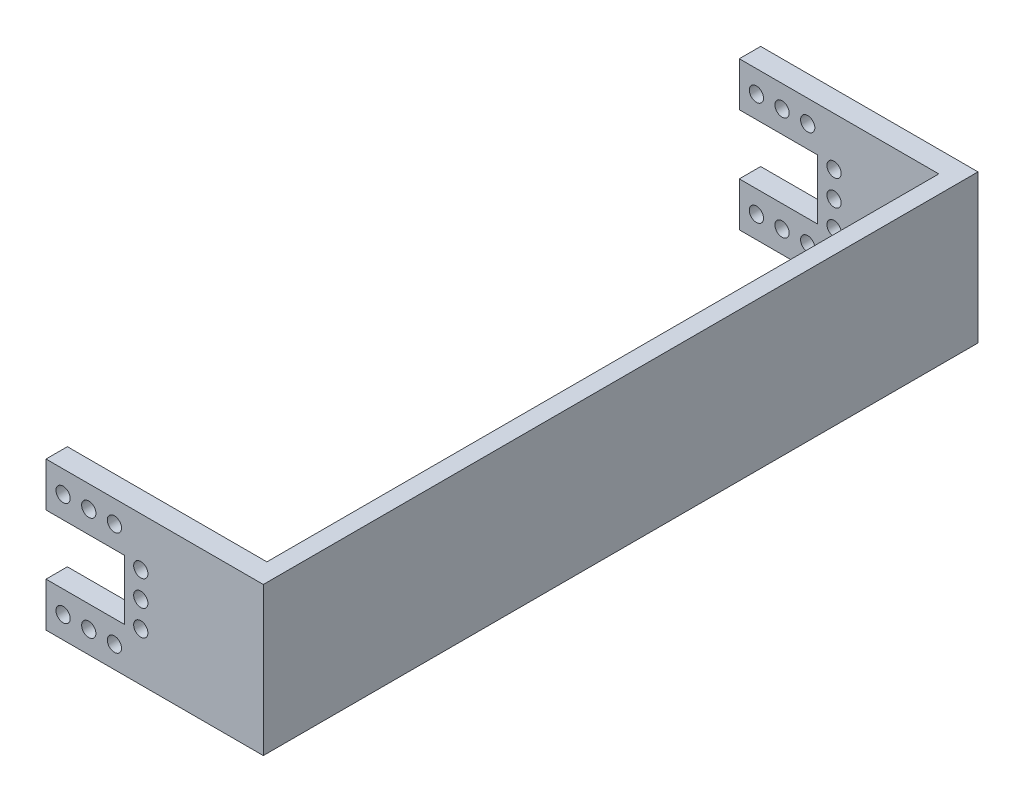
ISO-10303-21;
HEADER;
FILE_DESCRIPTION(('STEP AP214'),'2;1');
FILE_NAME('part.step','',(''),(''),'','','');
FILE_SCHEMA(('AUTOMOTIVE_DESIGN { 1 0 10303 214 1 1 1 1 }'));
ENDSEC;
DATA;
#1=APPLICATION_CONTEXT('core data for automotive mechanical design processes');
#2=APPLICATION_PROTOCOL_DEFINITION('international standard','automotive_design',2000,#1);
#3=PRODUCT_CONTEXT('',#1,'mechanical');
#4=PRODUCT('Part','Part','',(#3));
#5=PRODUCT_RELATED_PRODUCT_CATEGORY('part','',(#4));
#6=PRODUCT_DEFINITION_FORMATION('','',#4);
#7=PRODUCT_DEFINITION_CONTEXT('part definition',#1,'design');
#8=PRODUCT_DEFINITION('design','',#6,#7);
#9=PRODUCT_DEFINITION_SHAPE('','',#8);
#10=(LENGTH_UNIT() NAMED_UNIT(*) SI_UNIT(.MILLI.,.METRE.));
#11=(NAMED_UNIT(*) PLANE_ANGLE_UNIT() SI_UNIT($,.RADIAN.));
#12=(NAMED_UNIT(*) SI_UNIT($,.STERADIAN.) SOLID_ANGLE_UNIT());
#13=UNCERTAINTY_MEASURE_WITH_UNIT(LENGTH_MEASURE(1.E-05),#10,'distance_accuracy_value','');
#14=(GEOMETRIC_REPRESENTATION_CONTEXT(3) GLOBAL_UNCERTAINTY_ASSIGNED_CONTEXT((#13)) GLOBAL_UNIT_ASSIGNED_CONTEXT((#10,
#11,#12)) REPRESENTATION_CONTEXT('',''));
#15=CARTESIAN_POINT('',(0.,0.,0.));
#16=DIRECTION('',(0.,0.,1.));
#17=DIRECTION('',(1.,0.,0.));
#18=AXIS2_PLACEMENT_3D('',#15,#16,#17);
#19=CARTESIAN_POINT('',(32.45,0.,0.));
#20=DIRECTION('',(1.,0.,0.));
#21=DIRECTION('',(0.,0.,-1.));
#22=AXIS2_PLACEMENT_3D('',#19,#20,#21);
#23=PLANE('',#22);
#24=DIRECTION('',(0.,-1.,0.));
#25=VECTOR('',#24,1.);
#26=CARTESIAN_POINT('',(32.45,0.,46.85));
#27=LINE('',#26,#25);
#28=CARTESIAN_POINT('',(32.45,10.3999999999999,46.85));
#29=VERTEX_POINT('',#28);
#30=CARTESIAN_POINT('',(32.45,-10.3999999999999,46.85));
#31=VERTEX_POINT('',#30);
#32=EDGE_CURVE('E348',#29,#31,#27,.T.);
#33=ORIENTED_EDGE('',*,*,#32,.F.);
#34=DIRECTION('',(0.,0.,1.));
#35=VECTOR('',#34,1.);
#36=CARTESIAN_POINT('',(32.45,10.3999999999999,49.85));
#37=LINE('',#36,#35);
#38=CARTESIAN_POINT('',(32.45,10.3999999999999,-47.45));
#39=VERTEX_POINT('',#38);
#40=EDGE_CURVE('E397',#39,#29,#37,.T.);
#41=ORIENTED_EDGE('',*,*,#40,.F.);
#42=DIRECTION('',(0.,-1.,0.));
#43=VECTOR('',#42,1.);
#44=CARTESIAN_POINT('',(32.45,0.,-47.45));
#45=LINE('',#44,#43);
#46=CARTESIAN_POINT('',(32.45,-10.3999999999999,-47.45));
#47=VERTEX_POINT('',#46);
#48=EDGE_CURVE('E176',#39,#47,#45,.T.);
#49=ORIENTED_EDGE('',*,*,#48,.T.);
#50=DIRECTION('',(0.,0.,-1.));
#51=VECTOR('',#50,1.);
#52=CARTESIAN_POINT('',(32.45,-10.3999999999999,49.85));
#53=LINE('',#52,#51);
#54=EDGE_CURVE('E36',#31,#47,#53,.T.);
#55=ORIENTED_EDGE('',*,*,#54,.F.);
#56=EDGE_LOOP('',(#33,#41,#49,#55));
#57=FACE_BOUND('',#56,.T.);
#58=ADVANCED_FACE('F32',(#57),#23,.F.);
#59=CARTESIAN_POINT('',(0.,-10.4000000000002,-50.45));
#60=DIRECTION('',(0.,-1.,0.));
#61=DIRECTION('',(1.,0.,0.));
#62=AXIS2_PLACEMENT_3D('',#59,#60,#61);
#63=PLANE('',#62);
#64=DIRECTION('',(1.,0.,0.));
#65=VECTOR('',#64,1.);
#66=CARTESIAN_POINT('',(0.,-10.4000000000002,-47.45));
#67=LINE('',#66,#65);
#68=CARTESIAN_POINT('',(4.45,-10.4000000000001,-47.45));
#69=VERTEX_POINT('',#68);
#70=EDGE_CURVE('E162',#69,#47,#67,.T.);
#71=ORIENTED_EDGE('',*,*,#70,.F.);
#72=DIRECTION('',(0.,0.,1.));
#73=VECTOR('',#72,1.);
#74=CARTESIAN_POINT('',(4.45,-10.4000000000001,-50.45));
#75=LINE('',#74,#73);
#76=CARTESIAN_POINT('',(4.45,-10.4000000000001,-50.45));
#77=VERTEX_POINT('',#76);
#78=EDGE_CURVE('E11',#77,#69,#75,.T.);
#79=ORIENTED_EDGE('',*,*,#78,.F.);
#80=DIRECTION('',(1.,0.,0.));
#81=VECTOR('',#80,1.);
#82=CARTESIAN_POINT('',(0.,-10.4000000000002,-50.45));
#83=LINE('',#82,#81);
#84=CARTESIAN_POINT('',(34.95,-10.3999999999999,-50.45));
#85=VERTEX_POINT('',#84);
#86=EDGE_CURVE('E194',#77,#85,#83,.T.);
#87=ORIENTED_EDGE('',*,*,#86,.T.);
#88=DIRECTION('',(0.,0.,-1.));
#89=VECTOR('',#88,1.);
#90=CARTESIAN_POINT('',(34.95,-10.3999999999999,49.85));
#91=LINE('',#90,#89);
#92=CARTESIAN_POINT('',(34.95,-10.3999999999999,49.85));
#93=VERTEX_POINT('',#92);
#94=EDGE_CURVE('E396',#93,#85,#91,.T.);
#95=ORIENTED_EDGE('',*,*,#94,.F.);
#96=DIRECTION('',(-1.,0.,0.));
#97=VECTOR('',#96,1.);
#98=CARTESIAN_POINT('',(34.95,-10.3999999999999,49.85));
#99=LINE('',#98,#97);
#100=CARTESIAN_POINT('',(4.45,-10.4000000000001,49.85));
#101=VERTEX_POINT('',#100);
#102=EDGE_CURVE('E184',#93,#101,#99,.T.);
#103=ORIENTED_EDGE('',*,*,#102,.T.);
#104=DIRECTION('',(0.,0.,-1.));
#105=VECTOR('',#104,1.);
#106=CARTESIAN_POINT('',(4.45,-10.4000000000001,49.85));
#107=LINE('',#106,#105);
#108=CARTESIAN_POINT('',(4.45,-10.4000000000001,46.85));
#109=VERTEX_POINT('',#108);
#110=EDGE_CURVE('E390',#101,#109,#107,.T.);
#111=ORIENTED_EDGE('',*,*,#110,.T.);
#112=DIRECTION('',(1.,0.,0.));
#113=VECTOR('',#112,1.);
#114=CARTESIAN_POINT('',(0.,-10.4000000000002,46.85));
#115=LINE('',#114,#113);
#116=EDGE_CURVE('E327',#109,#31,#115,.T.);
#117=ORIENTED_EDGE('',*,*,#116,.T.);
#118=ORIENTED_EDGE('',*,*,#54,.T.);
#119=EDGE_LOOP('',(#71,#79,#87,#95,#103,#111,#117,#118));
#120=FACE_BOUND('',#119,.T.);
#121=ADVANCED_FACE('F34',(#120),#63,.T.);
#122=CARTESIAN_POINT('',(4.45,0.,-50.45));
#123=DIRECTION('',(1.,0.,0.));
#124=DIRECTION('',(0.,0.,-1.));
#125=AXIS2_PLACEMENT_3D('',#122,#123,#124);
#126=PLANE('',#125);
#127=DIRECTION('',(0.,1.,0.));
#128=VECTOR('',#127,1.);
#129=CARTESIAN_POINT('',(4.45,0.,-47.45));
#130=LINE('',#129,#128);
#131=CARTESIAN_POINT('',(4.45,-4.19999999999995,-47.45));
#132=VERTEX_POINT('',#131);
#133=EDGE_CURVE('E159',#69,#132,#130,.T.);
#134=ORIENTED_EDGE('',*,*,#133,.T.);
#135=DIRECTION('',(0.,0.,1.));
#136=VECTOR('',#135,1.);
#137=CARTESIAN_POINT('',(4.45,-4.19999999999995,-50.45));
#138=LINE('',#137,#136);
#139=CARTESIAN_POINT('',(4.45,-4.19999999999995,-50.45));
#140=VERTEX_POINT('',#139);
#141=EDGE_CURVE('E43',#140,#132,#138,.T.);
#142=ORIENTED_EDGE('',*,*,#141,.F.);
#143=DIRECTION('',(0.,1.,0.));
#144=VECTOR('',#143,1.);
#145=CARTESIAN_POINT('',(4.45,0.,-50.45));
#146=LINE('',#145,#144);
#147=EDGE_CURVE('E413',#77,#140,#146,.T.);
#148=ORIENTED_EDGE('',*,*,#147,.F.);
#149=ORIENTED_EDGE('',*,*,#78,.T.);
#150=EDGE_LOOP('',(#134,#142,#148,#149));
#151=FACE_BOUND('',#150,.T.);
#152=ADVANCED_FACE('F262',(#151),#126,.F.);
#153=CARTESIAN_POINT('',(0.,-4.19999999999995,-50.45));
#154=DIRECTION('',(0.,-1.,0.));
#155=DIRECTION('',(0.,0.,-1.));
#156=AXIS2_PLACEMENT_3D('',#153,#154,#155);
#157=PLANE('',#156);
#158=DIRECTION('',(1.,0.,0.));
#159=VECTOR('',#158,1.);
#160=CARTESIAN_POINT('',(0.,-4.19999999999995,-47.45));
#161=LINE('',#160,#159);
#162=CARTESIAN_POINT('',(15.45,-4.19999999999995,-47.45));
#163=VERTEX_POINT('',#162);
#164=EDGE_CURVE('E161',#132,#163,#161,.T.);
#165=ORIENTED_EDGE('',*,*,#164,.T.);
#166=DIRECTION('',(0.,0.,1.));
#167=VECTOR('',#166,1.);
#168=CARTESIAN_POINT('',(15.45,-4.19999999999995,-50.45));
#169=LINE('',#168,#167);
#170=CARTESIAN_POINT('',(15.45,-4.19999999999995,-50.45));
#171=VERTEX_POINT('',#170);
#172=EDGE_CURVE('E109',#171,#163,#169,.T.);
#173=ORIENTED_EDGE('',*,*,#172,.F.);
#174=DIRECTION('',(1.,0.,0.));
#175=VECTOR('',#174,1.);
#176=CARTESIAN_POINT('',(0.,-4.19999999999995,-50.45));
#177=LINE('',#176,#175);
#178=EDGE_CURVE('E120',#140,#171,#177,.T.);
#179=ORIENTED_EDGE('',*,*,#178,.F.);
#180=ORIENTED_EDGE('',*,*,#141,.T.);
#181=EDGE_LOOP('',(#165,#173,#179,#180));
#182=FACE_BOUND('',#181,.T.);
#183=ADVANCED_FACE('F420',(#182),#157,.F.);
#184=CARTESIAN_POINT('',(15.45,0.,-50.45));
#185=DIRECTION('',(-1.,0.,0.));
#186=DIRECTION('',(0.,-1.,0.));
#187=AXIS2_PLACEMENT_3D('',#184,#185,#186);
#188=PLANE('',#187);
#189=DIRECTION('',(0.,-1.,0.));
#190=VECTOR('',#189,1.);
#191=CARTESIAN_POINT('',(15.45,0.,-47.45));
#192=LINE('',#191,#190);
#193=CARTESIAN_POINT('',(15.45,4.19999999999995,-47.45));
#194=VERTEX_POINT('',#193);
#195=EDGE_CURVE('E104',#194,#163,#192,.T.);
#196=ORIENTED_EDGE('',*,*,#195,.F.);
#197=DIRECTION('',(0.,0.,1.));
#198=VECTOR('',#197,1.);
#199=CARTESIAN_POINT('',(15.45,4.19999999999995,-50.45));
#200=LINE('',#199,#198);
#201=CARTESIAN_POINT('',(15.45,4.19999999999995,-50.45));
#202=VERTEX_POINT('',#201);
#203=EDGE_CURVE('E99',#202,#194,#200,.T.);
#204=ORIENTED_EDGE('',*,*,#203,.F.);
#205=DIRECTION('',(0.,-1.,0.));
#206=VECTOR('',#205,1.);
#207=CARTESIAN_POINT('',(15.45,0.,-50.45));
#208=LINE('',#207,#206);
#209=EDGE_CURVE('E102',#202,#171,#208,.T.);
#210=ORIENTED_EDGE('',*,*,#209,.T.);
#211=ORIENTED_EDGE('',*,*,#172,.T.);
#212=EDGE_LOOP('',(#196,#204,#210,#211));
#213=FACE_BOUND('',#212,.T.);
#214=ADVANCED_FACE('F101',(#213),#188,.T.);
#215=CARTESIAN_POINT('',(0.,4.19999999999995,-50.45));
#216=DIRECTION('',(0.,-1.,0.));
#217=DIRECTION('',(1.,0.,0.));
#218=AXIS2_PLACEMENT_3D('',#215,#216,#217);
#219=PLANE('',#218);
#220=DIRECTION('',(1.,0.,0.));
#221=VECTOR('',#220,1.);
#222=CARTESIAN_POINT('',(0.,4.19999999999995,-47.45));
#223=LINE('',#222,#221);
#224=CARTESIAN_POINT('',(4.45,4.19999999999995,-47.45));
#225=VERTEX_POINT('',#224);
#226=EDGE_CURVE('E166',#225,#194,#223,.T.);
#227=ORIENTED_EDGE('',*,*,#226,.F.);
#228=DIRECTION('',(0.,0.,1.));
#229=VECTOR('',#228,1.);
#230=CARTESIAN_POINT('',(4.45,4.19999999999995,-50.45));
#231=LINE('',#230,#229);
#232=CARTESIAN_POINT('',(4.45,4.19999999999995,-50.45));
#233=VERTEX_POINT('',#232);
#234=EDGE_CURVE('E110',#233,#225,#231,.T.);
#235=ORIENTED_EDGE('',*,*,#234,.F.);
#236=DIRECTION('',(1.,0.,0.));
#237=VECTOR('',#236,1.);
#238=CARTESIAN_POINT('',(0.,4.19999999999995,-50.45));
#239=LINE('',#238,#237);
#240=EDGE_CURVE('E118',#233,#202,#239,.T.);
#241=ORIENTED_EDGE('',*,*,#240,.T.);
#242=ORIENTED_EDGE('',*,*,#203,.T.);
#243=EDGE_LOOP('',(#227,#235,#241,#242));
#244=FACE_BOUND('',#243,.T.);
#245=ADVANCED_FACE('F123',(#244),#219,.T.);
#246=CARTESIAN_POINT('',(4.45,0.,-50.45));
#247=DIRECTION('',(-1.,0.,0.));
#248=DIRECTION('',(0.,-1.,0.));
#249=AXIS2_PLACEMENT_3D('',#246,#247,#248);
#250=PLANE('',#249);
#251=DIRECTION('',(0.,-1.,0.));
#252=VECTOR('',#251,1.);
#253=CARTESIAN_POINT('',(4.45,0.,-47.45));
#254=LINE('',#253,#252);
#255=CARTESIAN_POINT('',(4.45,10.4000000000001,-47.45));
#256=VERTEX_POINT('',#255);
#257=EDGE_CURVE('E168',#256,#225,#254,.T.);
#258=ORIENTED_EDGE('',*,*,#257,.F.);
#259=DIRECTION('',(0.,0.,1.));
#260=VECTOR('',#259,1.);
#261=CARTESIAN_POINT('',(4.45,10.4000000000001,-50.45));
#262=LINE('',#261,#260);
#263=CARTESIAN_POINT('',(4.45,10.4000000000001,-50.45));
#264=VERTEX_POINT('',#263);
#265=EDGE_CURVE('E52',#264,#256,#262,.T.);
#266=ORIENTED_EDGE('',*,*,#265,.F.);
#267=DIRECTION('',(0.,-1.,0.));
#268=VECTOR('',#267,1.);
#269=CARTESIAN_POINT('',(4.45,0.,-50.45));
#270=LINE('',#269,#268);
#271=EDGE_CURVE('E124',#264,#233,#270,.T.);
#272=ORIENTED_EDGE('',*,*,#271,.T.);
#273=ORIENTED_EDGE('',*,*,#234,.T.);
#274=EDGE_LOOP('',(#258,#266,#272,#273));
#275=FACE_BOUND('',#274,.T.);
#276=ADVANCED_FACE('F421',(#275),#250,.T.);
#277=CARTESIAN_POINT('',(1.06706648936915E-13,10.4000000000001,-50.45));
#278=DIRECTION('',(0.,-1.,0.));
#279=DIRECTION('',(1.,0.,0.));
#280=AXIS2_PLACEMENT_3D('',#277,#278,#279);
#281=PLANE('',#280);
#282=DIRECTION('',(1.,0.,0.));
#283=VECTOR('',#282,1.);
#284=CARTESIAN_POINT('',(1.06706648936915E-13,10.4000000000001,-47.45));
#285=LINE('',#284,#283);
#286=EDGE_CURVE('E79',#256,#39,#285,.T.);
#287=ORIENTED_EDGE('',*,*,#286,.T.);
#288=ORIENTED_EDGE('',*,*,#40,.T.);
#289=DIRECTION('',(1.,0.,0.));
#290=VECTOR('',#289,1.);
#291=CARTESIAN_POINT('',(1.06706648936915E-13,10.4000000000001,46.85));
#292=LINE('',#291,#290);
#293=CARTESIAN_POINT('',(4.45,10.4000000000001,46.85));
#294=VERTEX_POINT('',#293);
#295=EDGE_CURVE('E345',#294,#29,#292,.T.);
#296=ORIENTED_EDGE('',*,*,#295,.F.);
#297=DIRECTION('',(0.,0.,-1.));
#298=VECTOR('',#297,1.);
#299=CARTESIAN_POINT('',(4.45,10.4000000000001,49.85));
#300=LINE('',#299,#298);
#301=CARTESIAN_POINT('',(4.45,10.4000000000001,49.85));
#302=VERTEX_POINT('',#301);
#303=EDGE_CURVE('E319',#302,#294,#300,.T.);
#304=ORIENTED_EDGE('',*,*,#303,.F.);
#305=DIRECTION('',(-1.,0.,0.));
#306=VECTOR('',#305,1.);
#307=CARTESIAN_POINT('',(34.95,10.3999999999999,49.85));
#308=LINE('',#307,#306);
#309=CARTESIAN_POINT('',(34.95,10.3999999999999,49.85));
#310=VERTEX_POINT('',#309);
#311=EDGE_CURVE('E281',#310,#302,#308,.T.);
#312=ORIENTED_EDGE('',*,*,#311,.F.);
#313=DIRECTION('',(0.,0.,1.));
#314=VECTOR('',#313,1.);
#315=CARTESIAN_POINT('',(34.95,10.3999999999999,49.85));
#316=LINE('',#315,#314);
#317=CARTESIAN_POINT('',(34.95,10.3999999999999,-50.45));
#318=VERTEX_POINT('',#317);
#319=EDGE_CURVE('E403',#318,#310,#316,.T.);
#320=ORIENTED_EDGE('',*,*,#319,.F.);
#321=DIRECTION('',(1.,0.,0.));
#322=VECTOR('',#321,1.);
#323=CARTESIAN_POINT('',(1.06706648936915E-13,10.4000000000001,-50.45));
#324=LINE('',#323,#322);
#325=EDGE_CURVE('E126',#264,#318,#324,.T.);
#326=ORIENTED_EDGE('',*,*,#325,.F.);
#327=ORIENTED_EDGE('',*,*,#265,.T.);
#328=EDGE_LOOP('',(#287,#288,#296,#304,#312,#320,#326,#327));
#329=FACE_BOUND('',#328,.T.);
#330=ADVANCED_FACE('F428',(#329),#281,.F.);
#331=CARTESIAN_POINT('',(17.75,-3.60000000000005,-50.45));
#332=DIRECTION('',(0.,0.,1.));
#333=DIRECTION('',(1.,0.,0.));
#334=AXIS2_PLACEMENT_3D('',#331,#332,#333);
#335=CYLINDRICAL_SURFACE('',#334,1.);
#336=CARTESIAN_POINT('',(17.75,-3.60000000000005,-50.45));
#337=DIRECTION('',(0.,0.,-1.));
#338=DIRECTION('',(-1.,0.,0.));
#339=AXIS2_PLACEMENT_3D('',#336,#337,#338);
#340=CIRCLE('',#339,1.);
#341=CARTESIAN_POINT('',(16.75,-3.60000000000005,-50.45));
#342=VERTEX_POINT('',#341);
#343=EDGE_CURVE('E153',#342,#342,#340,.F.);
#344=ORIENTED_EDGE('',*,*,#343,.F.);
#345=EDGE_LOOP('',(#344));
#346=FACE_BOUND('',#345,.T.);
#347=CARTESIAN_POINT('',(17.75,-3.60000000000005,-47.45));
#348=DIRECTION('',(0.,0.,-1.));
#349=DIRECTION('',(-1.,0.,0.));
#350=AXIS2_PLACEMENT_3D('',#347,#348,#349);
#351=CIRCLE('',#350,1.);
#352=CARTESIAN_POINT('',(16.75,-3.60000000000005,-47.45));
#353=VERTEX_POINT('',#352);
#354=EDGE_CURVE('E195',#353,#353,#351,.F.);
#355=ORIENTED_EDGE('',*,*,#354,.T.);
#356=EDGE_LOOP('',(#355));
#357=FACE_BOUND('',#356,.T.);
#358=ADVANCED_FACE('F678',(#346,#357),#335,.F.);
#359=CARTESIAN_POINT('',(10.4499999999999,-7.29999999999995,-50.45));
#360=DIRECTION('',(0.,0.,1.));
#361=DIRECTION('',(1.,0.,0.));
#362=AXIS2_PLACEMENT_3D('',#359,#360,#361);
#363=CYLINDRICAL_SURFACE('',#362,1.);
#364=CARTESIAN_POINT('',(10.4499999999999,-7.29999999999995,-50.45));
#365=DIRECTION('',(0.,0.,-1.));
#366=DIRECTION('',(-1.,0.,0.));
#367=AXIS2_PLACEMENT_3D('',#364,#365,#366);
#368=CIRCLE('',#367,1.);
#369=CARTESIAN_POINT('',(9.44999999999987,-7.29999999999995,-50.45));
#370=VERTEX_POINT('',#369);
#371=EDGE_CURVE('E150',#370,#370,#368,.F.);
#372=ORIENTED_EDGE('',*,*,#371,.F.);
#373=EDGE_LOOP('',(#372));
#374=FACE_BOUND('',#373,.T.);
#375=CARTESIAN_POINT('',(10.4499999999999,-7.29999999999995,-47.45));
#376=DIRECTION('',(0.,0.,-1.));
#377=DIRECTION('',(-1.,0.,0.));
#378=AXIS2_PLACEMENT_3D('',#375,#376,#377);
#379=CIRCLE('',#378,1.);
#380=CARTESIAN_POINT('',(9.44999999999987,-7.29999999999995,-47.45));
#381=VERTEX_POINT('',#380);
#382=EDGE_CURVE('E198',#381,#381,#379,.F.);
#383=ORIENTED_EDGE('',*,*,#382,.T.);
#384=EDGE_LOOP('',(#383));
#385=FACE_BOUND('',#384,.T.);
#386=ADVANCED_FACE('F839',(#374,#385),#363,.F.);
#387=CARTESIAN_POINT('',(6.84999999999987,-7.29999999999991,-50.45));
#388=DIRECTION('',(0.,0.,1.));
#389=DIRECTION('',(1.,0.,0.));
#390=AXIS2_PLACEMENT_3D('',#387,#388,#389);
#391=CYLINDRICAL_SURFACE('',#390,0.999999999999999);
#392=CARTESIAN_POINT('',(6.84999999999987,-7.29999999999991,-50.45));
#393=DIRECTION('',(0.,0.,-1.));
#394=DIRECTION('',(-1.,0.,0.));
#395=AXIS2_PLACEMENT_3D('',#392,#393,#394);
#396=CIRCLE('',#395,0.999999999999999);
#397=CARTESIAN_POINT('',(5.84999999999987,-7.29999999999991,-50.45));
#398=VERTEX_POINT('',#397);
#399=EDGE_CURVE('E147',#398,#398,#396,.F.);
#400=ORIENTED_EDGE('',*,*,#399,.F.);
#401=EDGE_LOOP('',(#400));
#402=FACE_BOUND('',#401,.T.);
#403=CARTESIAN_POINT('',(6.84999999999987,-7.29999999999991,-47.45));
#404=DIRECTION('',(0.,0.,-1.));
#405=DIRECTION('',(-1.,0.,0.));
#406=AXIS2_PLACEMENT_3D('',#403,#404,#405);
#407=CIRCLE('',#406,0.999999999999999);
#408=CARTESIAN_POINT('',(5.84999999999987,-7.29999999999991,-47.45));
#409=VERTEX_POINT('',#408);
#410=EDGE_CURVE('E201',#409,#409,#407,.F.);
#411=ORIENTED_EDGE('',*,*,#410,.T.);
#412=EDGE_LOOP('',(#411));
#413=FACE_BOUND('',#412,.T.);
#414=ADVANCED_FACE('F830',(#402,#413),#391,.F.);
#415=CARTESIAN_POINT('',(14.0500000000002,7.29999999999999,-50.45));
#416=DIRECTION('',(0.,0.,1.));
#417=DIRECTION('',(1.,0.,0.));
#418=AXIS2_PLACEMENT_3D('',#415,#416,#417);
#419=CYLINDRICAL_SURFACE('',#418,1.);
#420=CARTESIAN_POINT('',(14.0500000000002,7.29999999999999,-50.45));
#421=DIRECTION('',(0.,0.,-1.));
#422=DIRECTION('',(-1.,0.,0.));
#423=AXIS2_PLACEMENT_3D('',#420,#421,#422);
#424=CIRCLE('',#423,1.);
#425=CARTESIAN_POINT('',(13.0500000000002,7.29999999999999,-50.45));
#426=VERTEX_POINT('',#425);
#427=EDGE_CURVE('E144',#426,#426,#424,.F.);
#428=ORIENTED_EDGE('',*,*,#427,.F.);
#429=EDGE_LOOP('',(#428));
#430=FACE_BOUND('',#429,.T.);
#431=CARTESIAN_POINT('',(14.0500000000002,7.29999999999999,-47.45));
#432=DIRECTION('',(0.,0.,-1.));
#433=DIRECTION('',(-1.,0.,0.));
#434=AXIS2_PLACEMENT_3D('',#431,#432,#433);
#435=CIRCLE('',#434,1.);
#436=CARTESIAN_POINT('',(13.0500000000002,7.29999999999999,-47.45));
#437=VERTEX_POINT('',#436);
#438=EDGE_CURVE('E204',#437,#437,#435,.F.);
#439=ORIENTED_EDGE('',*,*,#438,.T.);
#440=EDGE_LOOP('',(#439));
#441=FACE_BOUND('',#440,.T.);
#442=ADVANCED_FACE('F821',(#430,#441),#419,.F.);
#443=CARTESIAN_POINT('',(10.4500000000002,7.30000000000005,-50.45));
#444=DIRECTION('',(0.,0.,1.));
#445=DIRECTION('',(1.,0.,0.));
#446=AXIS2_PLACEMENT_3D('',#443,#444,#445);
#447=CYLINDRICAL_SURFACE('',#446,1.);
#448=CARTESIAN_POINT('',(10.4500000000002,7.30000000000005,-50.45));
#449=DIRECTION('',(0.,0.,-1.));
#450=DIRECTION('',(-1.,0.,0.));
#451=AXIS2_PLACEMENT_3D('',#448,#449,#450);
#452=CIRCLE('',#451,1.);
#453=CARTESIAN_POINT('',(9.45000000000018,7.30000000000005,-50.45));
#454=VERTEX_POINT('',#453);
#455=EDGE_CURVE('E141',#454,#454,#452,.F.);
#456=ORIENTED_EDGE('',*,*,#455,.F.);
#457=EDGE_LOOP('',(#456));
#458=FACE_BOUND('',#457,.T.);
#459=CARTESIAN_POINT('',(10.4500000000002,7.30000000000005,-47.45));
#460=DIRECTION('',(0.,0.,-1.));
#461=DIRECTION('',(-1.,0.,0.));
#462=AXIS2_PLACEMENT_3D('',#459,#460,#461);
#463=CIRCLE('',#462,1.);
#464=CARTESIAN_POINT('',(9.45000000000018,7.30000000000005,-47.45));
#465=VERTEX_POINT('',#464);
#466=EDGE_CURVE('E207',#465,#465,#463,.F.);
#467=ORIENTED_EDGE('',*,*,#466,.T.);
#468=EDGE_LOOP('',(#467));
#469=FACE_BOUND('',#468,.T.);
#470=ADVANCED_FACE('F812',(#458,#469),#447,.F.);
#471=CARTESIAN_POINT('',(17.75,3.59999999999995,-50.45));
#472=DIRECTION('',(0.,0.,1.));
#473=DIRECTION('',(1.,0.,0.));
#474=AXIS2_PLACEMENT_3D('',#471,#472,#473);
#475=CYLINDRICAL_SURFACE('',#474,0.999999999999998);
#476=CARTESIAN_POINT('',(17.75,3.59999999999995,-50.45));
#477=DIRECTION('',(0.,0.,-1.));
#478=DIRECTION('',(-1.,0.,0.));
#479=AXIS2_PLACEMENT_3D('',#476,#477,#478);
#480=CIRCLE('',#479,0.999999999999998);
#481=CARTESIAN_POINT('',(16.75,3.59999999999995,-50.45));
#482=VERTEX_POINT('',#481);
#483=EDGE_CURVE('E138',#482,#482,#480,.F.);
#484=ORIENTED_EDGE('',*,*,#483,.F.);
#485=EDGE_LOOP('',(#484));
#486=FACE_BOUND('',#485,.T.);
#487=CARTESIAN_POINT('',(17.75,3.59999999999995,-47.45));
#488=DIRECTION('',(0.,0.,-1.));
#489=DIRECTION('',(-1.,0.,0.));
#490=AXIS2_PLACEMENT_3D('',#487,#488,#489);
#491=CIRCLE('',#490,0.999999999999998);
#492=CARTESIAN_POINT('',(16.75,3.59999999999995,-47.45));
#493=VERTEX_POINT('',#492);
#494=EDGE_CURVE('E210',#493,#493,#491,.F.);
#495=ORIENTED_EDGE('',*,*,#494,.T.);
#496=EDGE_LOOP('',(#495));
#497=FACE_BOUND('',#496,.T.);
#498=ADVANCED_FACE('F803',(#486,#497),#475,.F.);
#499=CARTESIAN_POINT('',(6.85000000000018,7.30000000000009,-50.45));
#500=DIRECTION('',(0.,0.,1.));
#501=DIRECTION('',(1.,0.,0.));
#502=AXIS2_PLACEMENT_3D('',#499,#500,#501);
#503=CYLINDRICAL_SURFACE('',#502,0.999999999999998);
#504=CARTESIAN_POINT('',(6.85000000000018,7.30000000000009,-50.45));
#505=DIRECTION('',(0.,0.,-1.));
#506=DIRECTION('',(-1.,0.,0.));
#507=AXIS2_PLACEMENT_3D('',#504,#505,#506);
#508=CIRCLE('',#507,0.999999999999998);
#509=CARTESIAN_POINT('',(5.85000000000018,7.30000000000009,-50.45));
#510=VERTEX_POINT('',#509);
#511=EDGE_CURVE('E135',#510,#510,#508,.F.);
#512=ORIENTED_EDGE('',*,*,#511,.F.);
#513=EDGE_LOOP('',(#512));
#514=FACE_BOUND('',#513,.T.);
#515=CARTESIAN_POINT('',(6.85000000000018,7.30000000000009,-47.45));
#516=DIRECTION('',(0.,0.,-1.));
#517=DIRECTION('',(-1.,0.,0.));
#518=AXIS2_PLACEMENT_3D('',#515,#516,#517);
#519=CIRCLE('',#518,0.999999999999998);
#520=CARTESIAN_POINT('',(5.85000000000018,7.30000000000009,-47.45));
#521=VERTEX_POINT('',#520);
#522=EDGE_CURVE('E212',#521,#521,#519,.F.);
#523=ORIENTED_EDGE('',*,*,#522,.T.);
#524=EDGE_LOOP('',(#523));
#525=FACE_BOUND('',#524,.T.);
#526=ADVANCED_FACE('F251',(#514,#525),#503,.F.);
#527=CARTESIAN_POINT('',(17.75,0.,-50.45));
#528=DIRECTION('',(0.,0.,1.));
#529=DIRECTION('',(1.,0.,0.));
#530=AXIS2_PLACEMENT_3D('',#527,#528,#529);
#531=CYLINDRICAL_SURFACE('',#530,1.);
#532=CARTESIAN_POINT('',(17.75,0.,-50.45));
#533=DIRECTION('',(0.,0.,-1.));
#534=DIRECTION('',(-1.,0.,0.));
#535=AXIS2_PLACEMENT_3D('',#532,#533,#534);
#536=CIRCLE('',#535,1.);
#537=CARTESIAN_POINT('',(16.75,0.,-50.45));
#538=VERTEX_POINT('',#537);
#539=EDGE_CURVE('E132',#538,#538,#536,.F.);
#540=ORIENTED_EDGE('',*,*,#539,.F.);
#541=EDGE_LOOP('',(#540));
#542=FACE_BOUND('',#541,.T.);
#543=CARTESIAN_POINT('',(17.75,0.,-47.45));
#544=DIRECTION('',(0.,0.,-1.));
#545=DIRECTION('',(-1.,0.,0.));
#546=AXIS2_PLACEMENT_3D('',#543,#544,#545);
#547=CIRCLE('',#546,1.);
#548=CARTESIAN_POINT('',(16.75,0.,-47.45));
#549=VERTEX_POINT('',#548);
#550=EDGE_CURVE('E173',#549,#549,#547,.F.);
#551=ORIENTED_EDGE('',*,*,#550,.T.);
#552=EDGE_LOOP('',(#551));
#553=FACE_BOUND('',#552,.T.);
#554=ADVANCED_FACE('F219',(#542,#553),#531,.F.);
#555=CARTESIAN_POINT('',(14.0499999999999,-7.29999999999996,-50.45));
#556=DIRECTION('',(0.,0.,1.));
#557=DIRECTION('',(1.,0.,0.));
#558=AXIS2_PLACEMENT_3D('',#555,#556,#557);
#559=CYLINDRICAL_SURFACE('',#558,0.999999999999999);
#560=CARTESIAN_POINT('',(14.0499999999999,-7.29999999999996,-50.45));
#561=DIRECTION('',(0.,0.,-1.));
#562=DIRECTION('',(-1.,0.,0.));
#563=AXIS2_PLACEMENT_3D('',#560,#561,#562);
#564=CIRCLE('',#563,0.999999999999999);
#565=CARTESIAN_POINT('',(13.0499999999999,-7.29999999999996,-50.45));
#566=VERTEX_POINT('',#565);
#567=EDGE_CURVE('E156',#566,#566,#564,.F.);
#568=ORIENTED_EDGE('',*,*,#567,.F.);
#569=EDGE_LOOP('',(#568));
#570=FACE_BOUND('',#569,.T.);
#571=CARTESIAN_POINT('',(14.0499999999999,-7.29999999999996,-47.45));
#572=DIRECTION('',(0.,0.,-1.));
#573=DIRECTION('',(-1.,0.,0.));
#574=AXIS2_PLACEMENT_3D('',#571,#572,#573);
#575=CIRCLE('',#574,0.999999999999999);
#576=CARTESIAN_POINT('',(13.0499999999999,-7.29999999999996,-47.45));
#577=VERTEX_POINT('',#576);
#578=EDGE_CURVE('E191',#577,#577,#575,.F.);
#579=ORIENTED_EDGE('',*,*,#578,.T.);
#580=EDGE_LOOP('',(#579));
#581=FACE_BOUND('',#580,.T.);
#582=ADVANCED_FACE('F242',(#570,#581),#559,.F.);
#583=CARTESIAN_POINT('',(0.,0.,-50.45));
#584=DIRECTION('',(0.,0.,-1.));
#585=DIRECTION('',(-1.,0.,0.));
#586=AXIS2_PLACEMENT_3D('',#583,#584,#585);
#587=PLANE('',#586);
#588=ORIENTED_EDGE('',*,*,#86,.F.);
#589=ORIENTED_EDGE('',*,*,#147,.T.);
#590=ORIENTED_EDGE('',*,*,#178,.T.);
#591=ORIENTED_EDGE('',*,*,#209,.F.);
#592=ORIENTED_EDGE('',*,*,#240,.F.);
#593=ORIENTED_EDGE('',*,*,#271,.F.);
#594=ORIENTED_EDGE('',*,*,#325,.T.);
#595=DIRECTION('',(0.,1.,0.));
#596=VECTOR('',#595,1.);
#597=CARTESIAN_POINT('',(34.95,10.3999999999999,-50.45));
#598=LINE('',#597,#596);
#599=EDGE_CURVE('E400',#85,#318,#598,.T.);
#600=ORIENTED_EDGE('',*,*,#599,.F.);
#601=EDGE_LOOP('',(#588,#589,#590,#591,#592,#593,#594,#600));
#602=FACE_BOUND('',#601,.T.);
#603=ORIENTED_EDGE('',*,*,#539,.T.);
#604=EDGE_LOOP('',(#603));
#605=FACE_BOUND('',#604,.T.);
#606=ORIENTED_EDGE('',*,*,#511,.T.);
#607=EDGE_LOOP('',(#606));
#608=FACE_BOUND('',#607,.T.);
#609=ORIENTED_EDGE('',*,*,#483,.T.);
#610=EDGE_LOOP('',(#609));
#611=FACE_BOUND('',#610,.T.);
#612=ORIENTED_EDGE('',*,*,#455,.T.);
#613=EDGE_LOOP('',(#612));
#614=FACE_BOUND('',#613,.T.);
#615=ORIENTED_EDGE('',*,*,#427,.T.);
#616=EDGE_LOOP('',(#615));
#617=FACE_BOUND('',#616,.T.);
#618=ORIENTED_EDGE('',*,*,#399,.T.);
#619=EDGE_LOOP('',(#618));
#620=FACE_BOUND('',#619,.T.);
#621=ORIENTED_EDGE('',*,*,#371,.T.);
#622=EDGE_LOOP('',(#621));
#623=FACE_BOUND('',#622,.T.);
#624=ORIENTED_EDGE('',*,*,#343,.T.);
#625=EDGE_LOOP('',(#624));
#626=FACE_BOUND('',#625,.T.);
#627=ORIENTED_EDGE('',*,*,#567,.T.);
#628=EDGE_LOOP('',(#627));
#629=FACE_BOUND('',#628,.T.);
#630=ADVANCED_FACE('F115',(#602,#605,#608,#611,#614,#617,#620,#623,#626,#629),#587,.T.);
#631=CARTESIAN_POINT('',(0.,0.,-47.45));
#632=DIRECTION('',(0.,0.,-1.));
#633=DIRECTION('',(-1.,0.,0.));
#634=AXIS2_PLACEMENT_3D('',#631,#632,#633);
#635=PLANE('',#634);
#636=ORIENTED_EDGE('',*,*,#70,.T.);
#637=ORIENTED_EDGE('',*,*,#48,.F.);
#638=ORIENTED_EDGE('',*,*,#286,.F.);
#639=ORIENTED_EDGE('',*,*,#257,.T.);
#640=ORIENTED_EDGE('',*,*,#226,.T.);
#641=ORIENTED_EDGE('',*,*,#195,.T.);
#642=ORIENTED_EDGE('',*,*,#164,.F.);
#643=ORIENTED_EDGE('',*,*,#133,.F.);
#644=EDGE_LOOP('',(#636,#637,#638,#639,#640,#641,#642,#643));
#645=FACE_BOUND('',#644,.T.);
#646=ORIENTED_EDGE('',*,*,#550,.F.);
#647=EDGE_LOOP('',(#646));
#648=FACE_BOUND('',#647,.T.);
#649=ORIENTED_EDGE('',*,*,#522,.F.);
#650=EDGE_LOOP('',(#649));
#651=FACE_BOUND('',#650,.T.);
#652=ORIENTED_EDGE('',*,*,#494,.F.);
#653=EDGE_LOOP('',(#652));
#654=FACE_BOUND('',#653,.T.);
#655=ORIENTED_EDGE('',*,*,#466,.F.);
#656=EDGE_LOOP('',(#655));
#657=FACE_BOUND('',#656,.T.);
#658=ORIENTED_EDGE('',*,*,#438,.F.);
#659=EDGE_LOOP('',(#658));
#660=FACE_BOUND('',#659,.T.);
#661=ORIENTED_EDGE('',*,*,#410,.F.);
#662=EDGE_LOOP('',(#661));
#663=FACE_BOUND('',#662,.T.);
#664=ORIENTED_EDGE('',*,*,#382,.F.);
#665=EDGE_LOOP('',(#664));
#666=FACE_BOUND('',#665,.T.);
#667=ORIENTED_EDGE('',*,*,#354,.F.);
#668=EDGE_LOOP('',(#667));
#669=FACE_BOUND('',#668,.T.);
#670=ORIENTED_EDGE('',*,*,#578,.F.);
#671=EDGE_LOOP('',(#670));
#672=FACE_BOUND('',#671,.T.);
#673=ADVANCED_FACE('F221',(#645,#648,#651,#654,#657,#660,#663,#666,#669,#672),#635,.F.);
#674=CARTESIAN_POINT('',(34.95,10.3999999999999,49.85));
#675=DIRECTION('',(0.,0.,-1.));
#676=DIRECTION('',(-1.,0.,0.));
#677=AXIS2_PLACEMENT_3D('',#674,#675,#676);
#678=PLANE('',#677);
#679=ORIENTED_EDGE('',*,*,#311,.T.);
#680=DIRECTION('',(0.,-1.,0.));
#681=VECTOR('',#680,1.);
#682=CARTESIAN_POINT('',(4.45,0.,49.85));
#683=LINE('',#682,#681);
#684=CARTESIAN_POINT('',(4.45,4.19999999999995,49.85));
#685=VERTEX_POINT('',#684);
#686=EDGE_CURVE('E488',#302,#685,#683,.T.);
#687=ORIENTED_EDGE('',*,*,#686,.T.);
#688=DIRECTION('',(1.,0.,0.));
#689=VECTOR('',#688,1.);
#690=CARTESIAN_POINT('',(0.,4.19999999999995,49.85));
#691=LINE('',#690,#689);
#692=CARTESIAN_POINT('',(15.45,4.19999999999995,49.85));
#693=VERTEX_POINT('',#692);
#694=EDGE_CURVE('E499',#685,#693,#691,.T.);
#695=ORIENTED_EDGE('',*,*,#694,.T.);
#696=DIRECTION('',(0.,-1.,0.));
#697=VECTOR('',#696,1.);
#698=CARTESIAN_POINT('',(15.45,0.,49.85));
#699=LINE('',#698,#697);
#700=CARTESIAN_POINT('',(15.45,-4.19999999999995,49.85));
#701=VERTEX_POINT('',#700);
#702=EDGE_CURVE('E498',#693,#701,#699,.T.);
#703=ORIENTED_EDGE('',*,*,#702,.T.);
#704=DIRECTION('',(1.,0.,0.));
#705=VECTOR('',#704,1.);
#706=CARTESIAN_POINT('',(0.,-4.19999999999995,49.85));
#707=LINE('',#706,#705);
#708=CARTESIAN_POINT('',(4.45,-4.19999999999995,49.85));
#709=VERTEX_POINT('',#708);
#710=EDGE_CURVE('E473',#709,#701,#707,.T.);
#711=ORIENTED_EDGE('',*,*,#710,.F.);
#712=DIRECTION('',(0.,1.,0.));
#713=VECTOR('',#712,1.);
#714=CARTESIAN_POINT('',(4.45,0.,49.85));
#715=LINE('',#714,#713);
#716=EDGE_CURVE('E377',#101,#709,#715,.T.);
#717=ORIENTED_EDGE('',*,*,#716,.F.);
#718=ORIENTED_EDGE('',*,*,#102,.F.);
#719=DIRECTION('',(0.,-1.,0.));
#720=VECTOR('',#719,1.);
#721=CARTESIAN_POINT('',(34.95,10.3999999999999,49.85));
#722=LINE('',#721,#720);
#723=EDGE_CURVE('E393',#310,#93,#722,.T.);
#724=ORIENTED_EDGE('',*,*,#723,.F.);
#725=EDGE_LOOP('',(#679,#687,#695,#703,#711,#717,#718,#724));
#726=FACE_BOUND('',#725,.T.);
#727=CARTESIAN_POINT('',(17.75,0.,49.85));
#728=DIRECTION('',(0.,0.,-1.));
#729=DIRECTION('',(-1.,0.,0.));
#730=AXIS2_PLACEMENT_3D('',#727,#728,#729);
#731=CIRCLE('',#730,1.);
#732=CARTESIAN_POINT('',(16.75,0.,49.85));
#733=VERTEX_POINT('',#732);
#734=EDGE_CURVE('E286',#733,#733,#731,.F.);
#735=ORIENTED_EDGE('',*,*,#734,.F.);
#736=EDGE_LOOP('',(#735));
#737=FACE_BOUND('',#736,.T.);
#738=CARTESIAN_POINT('',(6.85000000000018,7.30000000000009,49.85));
#739=DIRECTION('',(0.,0.,-1.));
#740=DIRECTION('',(-1.,0.,0.));
#741=AXIS2_PLACEMENT_3D('',#738,#739,#740);
#742=CIRCLE('',#741,0.999999999999998);
#743=CARTESIAN_POINT('',(5.85000000000018,7.30000000000009,49.85));
#744=VERTEX_POINT('',#743);
#745=EDGE_CURVE('E290',#744,#744,#742,.F.);
#746=ORIENTED_EDGE('',*,*,#745,.F.);
#747=EDGE_LOOP('',(#746));
#748=FACE_BOUND('',#747,.T.);
#749=CARTESIAN_POINT('',(17.75,3.59999999999995,49.85));
#750=DIRECTION('',(0.,0.,-1.));
#751=DIRECTION('',(-1.,0.,0.));
#752=AXIS2_PLACEMENT_3D('',#749,#750,#751);
#753=CIRCLE('',#752,0.999999999999998);
#754=CARTESIAN_POINT('',(16.75,3.59999999999995,49.85));
#755=VERTEX_POINT('',#754);
#756=EDGE_CURVE('E294',#755,#755,#753,.F.);
#757=ORIENTED_EDGE('',*,*,#756,.F.);
#758=EDGE_LOOP('',(#757));
#759=FACE_BOUND('',#758,.T.);
#760=CARTESIAN_POINT('',(10.4500000000002,7.30000000000005,49.85));
#761=DIRECTION('',(0.,0.,-1.));
#762=DIRECTION('',(-1.,0.,0.));
#763=AXIS2_PLACEMENT_3D('',#760,#761,#762);
#764=CIRCLE('',#763,1.);
#765=CARTESIAN_POINT('',(9.45000000000018,7.30000000000005,49.85));
#766=VERTEX_POINT('',#765);
#767=EDGE_CURVE('E298',#766,#766,#764,.F.);
#768=ORIENTED_EDGE('',*,*,#767,.F.);
#769=EDGE_LOOP('',(#768));
#770=FACE_BOUND('',#769,.T.);
#771=CARTESIAN_POINT('',(14.0500000000002,7.29999999999999,49.85));
#772=DIRECTION('',(0.,0.,-1.));
#773=DIRECTION('',(-1.,0.,0.));
#774=AXIS2_PLACEMENT_3D('',#771,#772,#773);
#775=CIRCLE('',#774,1.);
#776=CARTESIAN_POINT('',(13.0500000000002,7.29999999999999,49.85));
#777=VERTEX_POINT('',#776);
#778=EDGE_CURVE('E302',#777,#777,#775,.F.);
#779=ORIENTED_EDGE('',*,*,#778,.F.);
#780=EDGE_LOOP('',(#779));
#781=FACE_BOUND('',#780,.T.);
#782=CARTESIAN_POINT('',(6.84999999999987,-7.29999999999991,49.85));
#783=DIRECTION('',(0.,0.,-1.));
#784=DIRECTION('',(-1.,0.,0.));
#785=AXIS2_PLACEMENT_3D('',#782,#783,#784);
#786=CIRCLE('',#785,0.999999999999999);
#787=CARTESIAN_POINT('',(5.84999999999987,-7.29999999999991,49.85));
#788=VERTEX_POINT('',#787);
#789=EDGE_CURVE('E306',#788,#788,#786,.F.);
#790=ORIENTED_EDGE('',*,*,#789,.F.);
#791=EDGE_LOOP('',(#790));
#792=FACE_BOUND('',#791,.T.);
#793=CARTESIAN_POINT('',(10.4499999999999,-7.29999999999995,49.85));
#794=DIRECTION('',(0.,0.,-1.));
#795=DIRECTION('',(-1.,0.,0.));
#796=AXIS2_PLACEMENT_3D('',#793,#794,#795);
#797=CIRCLE('',#796,1.);
#798=CARTESIAN_POINT('',(9.44999999999987,-7.29999999999995,49.85));
#799=VERTEX_POINT('',#798);
#800=EDGE_CURVE('E310',#799,#799,#797,.F.);
#801=ORIENTED_EDGE('',*,*,#800,.F.);
#802=EDGE_LOOP('',(#801));
#803=FACE_BOUND('',#802,.T.);
#804=CARTESIAN_POINT('',(17.75,-3.60000000000005,49.85));
#805=DIRECTION('',(0.,0.,-1.));
#806=DIRECTION('',(-1.,0.,0.));
#807=AXIS2_PLACEMENT_3D('',#804,#805,#806);
#808=CIRCLE('',#807,1.);
#809=CARTESIAN_POINT('',(16.75,-3.60000000000005,49.85));
#810=VERTEX_POINT('',#809);
#811=EDGE_CURVE('E314',#810,#810,#808,.F.);
#812=ORIENTED_EDGE('',*,*,#811,.F.);
#813=EDGE_LOOP('',(#812));
#814=FACE_BOUND('',#813,.T.);
#815=CARTESIAN_POINT('',(14.0499999999999,-7.29999999999996,49.85));
#816=DIRECTION('',(0.,0.,-1.));
#817=DIRECTION('',(-1.,0.,0.));
#818=AXIS2_PLACEMENT_3D('',#815,#816,#817);
#819=CIRCLE('',#818,0.999999999999999);
#820=CARTESIAN_POINT('',(13.0499999999999,-7.29999999999996,49.85));
#821=VERTEX_POINT('',#820);
#822=EDGE_CURVE('E317',#821,#821,#819,.F.);
#823=ORIENTED_EDGE('',*,*,#822,.F.);
#824=EDGE_LOOP('',(#823));
#825=FACE_BOUND('',#824,.T.);
#826=ADVANCED_FACE('F224',(#726,#737,#748,#759,#770,#781,#792,#803,#814,#825),#678,.F.);
#827=CARTESIAN_POINT('',(34.95,0.,0.));
#828=DIRECTION('',(1.,0.,0.));
#829=DIRECTION('',(0.,0.,-1.));
#830=AXIS2_PLACEMENT_3D('',#827,#828,#829);
#831=PLANE('',#830);
#832=ORIENTED_EDGE('',*,*,#723,.T.);
#833=ORIENTED_EDGE('',*,*,#94,.T.);
#834=ORIENTED_EDGE('',*,*,#599,.T.);
#835=ORIENTED_EDGE('',*,*,#319,.T.);
#836=EDGE_LOOP('',(#832,#833,#834,#835));
#837=FACE_BOUND('',#836,.T.);
#838=ADVANCED_FACE('F266',(#837),#831,.T.);
#839=CARTESIAN_POINT('',(4.45,0.,49.85));
#840=DIRECTION('',(1.,0.,0.));
#841=DIRECTION('',(0.,0.,1.));
#842=AXIS2_PLACEMENT_3D('',#839,#840,#841);
#843=PLANE('',#842);
#844=DIRECTION('',(0.,1.,0.));
#845=VECTOR('',#844,1.);
#846=CARTESIAN_POINT('',(4.45,0.,46.85));
#847=LINE('',#846,#845);
#848=CARTESIAN_POINT('',(4.45,-4.19999999999995,46.85));
#849=VERTEX_POINT('',#848);
#850=EDGE_CURVE('E330',#109,#849,#847,.T.);
#851=ORIENTED_EDGE('',*,*,#850,.F.);
#852=ORIENTED_EDGE('',*,*,#110,.F.);
#853=ORIENTED_EDGE('',*,*,#716,.T.);
#854=DIRECTION('',(0.,0.,-1.));
#855=VECTOR('',#854,1.);
#856=CARTESIAN_POINT('',(4.45,-4.19999999999995,49.85));
#857=LINE('',#856,#855);
#858=EDGE_CURVE('E387',#709,#849,#857,.T.);
#859=ORIENTED_EDGE('',*,*,#858,.T.);
#860=EDGE_LOOP('',(#851,#852,#853,#859));
#861=FACE_BOUND('',#860,.T.);
#862=ADVANCED_FACE('F273',(#861),#843,.F.);
#863=CARTESIAN_POINT('',(0.,-4.19999999999995,49.85));
#864=DIRECTION('',(0.,-1.,0.));
#865=DIRECTION('',(0.,0.,1.));
#866=AXIS2_PLACEMENT_3D('',#863,#864,#865);
#867=PLANE('',#866);
#868=DIRECTION('',(1.,0.,0.));
#869=VECTOR('',#868,1.);
#870=CARTESIAN_POINT('',(0.,-4.19999999999995,46.85));
#871=LINE('',#870,#869);
#872=CARTESIAN_POINT('',(15.45,-4.19999999999995,46.85));
#873=VERTEX_POINT('',#872);
#874=EDGE_CURVE('E333',#849,#873,#871,.T.);
#875=ORIENTED_EDGE('',*,*,#874,.F.);
#876=ORIENTED_EDGE('',*,*,#858,.F.);
#877=ORIENTED_EDGE('',*,*,#710,.T.);
#878=DIRECTION('',(0.,0.,-1.));
#879=VECTOR('',#878,1.);
#880=CARTESIAN_POINT('',(15.45,-4.19999999999995,49.85));
#881=LINE('',#880,#879);
#882=EDGE_CURVE('E384',#701,#873,#881,.T.);
#883=ORIENTED_EDGE('',*,*,#882,.T.);
#884=EDGE_LOOP('',(#875,#876,#877,#883));
#885=FACE_BOUND('',#884,.T.);
#886=ADVANCED_FACE('F564',(#885),#867,.F.);
#887=CARTESIAN_POINT('',(15.45,0.,49.85));
#888=DIRECTION('',(-1.,0.,0.));
#889=DIRECTION('',(0.,-1.,0.));
#890=AXIS2_PLACEMENT_3D('',#887,#888,#889);
#891=PLANE('',#890);
#892=DIRECTION('',(0.,-1.,0.));
#893=VECTOR('',#892,1.);
#894=CARTESIAN_POINT('',(15.45,0.,46.85));
#895=LINE('',#894,#893);
#896=CARTESIAN_POINT('',(15.45,4.19999999999995,46.85));
#897=VERTEX_POINT('',#896);
#898=EDGE_CURVE('E336',#897,#873,#895,.T.);
#899=ORIENTED_EDGE('',*,*,#898,.T.);
#900=ORIENTED_EDGE('',*,*,#882,.F.);
#901=ORIENTED_EDGE('',*,*,#702,.F.);
#902=DIRECTION('',(0.,0.,-1.));
#903=VECTOR('',#902,1.);
#904=CARTESIAN_POINT('',(15.45,4.19999999999995,49.85));
#905=LINE('',#904,#903);
#906=EDGE_CURVE('E381',#693,#897,#905,.T.);
#907=ORIENTED_EDGE('',*,*,#906,.T.);
#908=EDGE_LOOP('',(#899,#900,#901,#907));
#909=FACE_BOUND('',#908,.T.);
#910=ADVANCED_FACE('F496',(#909),#891,.T.);
#911=CARTESIAN_POINT('',(0.,4.19999999999995,49.85));
#912=DIRECTION('',(0.,-1.,0.));
#913=DIRECTION('',(1.,0.,0.));
#914=AXIS2_PLACEMENT_3D('',#911,#912,#913);
#915=PLANE('',#914);
#916=DIRECTION('',(1.,0.,0.));
#917=VECTOR('',#916,1.);
#918=CARTESIAN_POINT('',(0.,4.19999999999995,46.85));
#919=LINE('',#918,#917);
#920=CARTESIAN_POINT('',(4.45,4.19999999999995,46.85));
#921=VERTEX_POINT('',#920);
#922=EDGE_CURVE('E339',#921,#897,#919,.T.);
#923=ORIENTED_EDGE('',*,*,#922,.T.);
#924=ORIENTED_EDGE('',*,*,#906,.F.);
#925=ORIENTED_EDGE('',*,*,#694,.F.);
#926=DIRECTION('',(0.,0.,-1.));
#927=VECTOR('',#926,1.);
#928=CARTESIAN_POINT('',(4.45,4.19999999999995,49.85));
#929=LINE('',#928,#927);
#930=EDGE_CURVE('E322',#685,#921,#929,.T.);
#931=ORIENTED_EDGE('',*,*,#930,.T.);
#932=EDGE_LOOP('',(#923,#924,#925,#931));
#933=FACE_BOUND('',#932,.T.);
#934=ADVANCED_FACE('F492',(#933),#915,.T.);
#935=CARTESIAN_POINT('',(4.45,0.,49.85));
#936=DIRECTION('',(-1.,0.,0.));
#937=DIRECTION('',(0.,-1.,0.));
#938=AXIS2_PLACEMENT_3D('',#935,#936,#937);
#939=PLANE('',#938);
#940=DIRECTION('',(0.,-1.,0.));
#941=VECTOR('',#940,1.);
#942=CARTESIAN_POINT('',(4.45,0.,46.85));
#943=LINE('',#942,#941);
#944=EDGE_CURVE('E342',#294,#921,#943,.T.);
#945=ORIENTED_EDGE('',*,*,#944,.T.);
#946=ORIENTED_EDGE('',*,*,#930,.F.);
#947=ORIENTED_EDGE('',*,*,#686,.F.);
#948=ORIENTED_EDGE('',*,*,#303,.T.);
#949=EDGE_LOOP('',(#945,#946,#947,#948));
#950=FACE_BOUND('',#949,.T.);
#951=ADVANCED_FACE('F486',(#950),#939,.T.);
#952=CARTESIAN_POINT('',(17.75,-3.60000000000005,49.85));
#953=DIRECTION('',(0.,0.,-1.));
#954=DIRECTION('',(1.,0.,0.));
#955=AXIS2_PLACEMENT_3D('',#952,#953,#954);
#956=CYLINDRICAL_SURFACE('',#955,1.);
#957=ORIENTED_EDGE('',*,*,#811,.T.);
#958=EDGE_LOOP('',(#957));
#959=FACE_BOUND('',#958,.T.);
#960=CARTESIAN_POINT('',(17.75,-3.60000000000005,46.85));
#961=DIRECTION('',(0.,0.,-1.));
#962=DIRECTION('',(-1.,0.,0.));
#963=AXIS2_PLACEMENT_3D('',#960,#961,#962);
#964=CIRCLE('',#963,1.);
#965=CARTESIAN_POINT('',(16.75,-3.60000000000005,46.85));
#966=VERTEX_POINT('',#965);
#967=EDGE_CURVE('E372',#966,#966,#964,.F.);
#968=ORIENTED_EDGE('',*,*,#967,.F.);
#969=EDGE_LOOP('',(#968));
#970=FACE_BOUND('',#969,.T.);
#971=ADVANCED_FACE('F515',(#959,#970),#956,.F.);
#972=CARTESIAN_POINT('',(10.4499999999999,-7.29999999999995,49.85));
#973=DIRECTION('',(0.,0.,-1.));
#974=DIRECTION('',(1.,0.,0.));
#975=AXIS2_PLACEMENT_3D('',#972,#973,#974);
#976=CYLINDRICAL_SURFACE('',#975,1.);
#977=ORIENTED_EDGE('',*,*,#800,.T.);
#978=EDGE_LOOP('',(#977));
#979=FACE_BOUND('',#978,.T.);
#980=CARTESIAN_POINT('',(10.4499999999999,-7.29999999999995,46.85));
#981=DIRECTION('',(0.,0.,-1.));
#982=DIRECTION('',(-1.,0.,0.));
#983=AXIS2_PLACEMENT_3D('',#980,#981,#982);
#984=CIRCLE('',#983,1.);
#985=CARTESIAN_POINT('',(9.44999999999987,-7.29999999999995,46.85));
#986=VERTEX_POINT('',#985);
#987=EDGE_CURVE('E369',#986,#986,#984,.F.);
#988=ORIENTED_EDGE('',*,*,#987,.F.);
#989=EDGE_LOOP('',(#988));
#990=FACE_BOUND('',#989,.T.);
#991=ADVANCED_FACE('F511',(#979,#990),#976,.F.);
#992=CARTESIAN_POINT('',(6.84999999999987,-7.29999999999991,49.85));
#993=DIRECTION('',(0.,0.,-1.));
#994=DIRECTION('',(1.,0.,0.));
#995=AXIS2_PLACEMENT_3D('',#992,#993,#994);
#996=CYLINDRICAL_SURFACE('',#995,0.999999999999999);
#997=ORIENTED_EDGE('',*,*,#789,.T.);
#998=EDGE_LOOP('',(#997));
#999=FACE_BOUND('',#998,.T.);
#1000=CARTESIAN_POINT('',(6.84999999999987,-7.29999999999991,46.85));
#1001=DIRECTION('',(0.,0.,-1.));
#1002=DIRECTION('',(-1.,0.,0.));
#1003=AXIS2_PLACEMENT_3D('',#1000,#1001,#1002);
#1004=CIRCLE('',#1003,0.999999999999999);
#1005=CARTESIAN_POINT('',(5.84999999999987,-7.29999999999991,46.85));
#1006=VERTEX_POINT('',#1005);
#1007=EDGE_CURVE('E366',#1006,#1006,#1004,.F.);
#1008=ORIENTED_EDGE('',*,*,#1007,.F.);
#1009=EDGE_LOOP('',(#1008));
#1010=FACE_BOUND('',#1009,.T.);
#1011=ADVANCED_FACE('F514',(#999,#1010),#996,.F.);
#1012=CARTESIAN_POINT('',(14.0500000000002,7.29999999999999,49.85));
#1013=DIRECTION('',(0.,0.,-1.));
#1014=DIRECTION('',(1.,0.,0.));
#1015=AXIS2_PLACEMENT_3D('',#1012,#1013,#1014);
#1016=CYLINDRICAL_SURFACE('',#1015,1.);
#1017=ORIENTED_EDGE('',*,*,#778,.T.);
#1018=EDGE_LOOP('',(#1017));
#1019=FACE_BOUND('',#1018,.T.);
#1020=CARTESIAN_POINT('',(14.0500000000002,7.29999999999999,46.85));
#1021=DIRECTION('',(0.,0.,-1.));
#1022=DIRECTION('',(-1.,0.,0.));
#1023=AXIS2_PLACEMENT_3D('',#1020,#1021,#1022);
#1024=CIRCLE('',#1023,1.);
#1025=CARTESIAN_POINT('',(13.0500000000002,7.29999999999999,46.85));
#1026=VERTEX_POINT('',#1025);
#1027=EDGE_CURVE('E363',#1026,#1026,#1024,.F.);
#1028=ORIENTED_EDGE('',*,*,#1027,.F.);
#1029=EDGE_LOOP('',(#1028));
#1030=FACE_BOUND('',#1029,.T.);
#1031=ADVANCED_FACE('F542',(#1019,#1030),#1016,.F.);
#1032=CARTESIAN_POINT('',(10.4500000000002,7.30000000000005,49.85));
#1033=DIRECTION('',(0.,0.,-1.));
#1034=DIRECTION('',(1.,0.,0.));
#1035=AXIS2_PLACEMENT_3D('',#1032,#1033,#1034);
#1036=CYLINDRICAL_SURFACE('',#1035,1.);
#1037=ORIENTED_EDGE('',*,*,#767,.T.);
#1038=EDGE_LOOP('',(#1037));
#1039=FACE_BOUND('',#1038,.T.);
#1040=CARTESIAN_POINT('',(10.4500000000002,7.30000000000005,46.85));
#1041=DIRECTION('',(0.,0.,-1.));
#1042=DIRECTION('',(-1.,0.,0.));
#1043=AXIS2_PLACEMENT_3D('',#1040,#1041,#1042);
#1044=CIRCLE('',#1043,1.);
#1045=CARTESIAN_POINT('',(9.45000000000018,7.30000000000005,46.85));
#1046=VERTEX_POINT('',#1045);
#1047=EDGE_CURVE('E360',#1046,#1046,#1044,.F.);
#1048=ORIENTED_EDGE('',*,*,#1047,.F.);
#1049=EDGE_LOOP('',(#1048));
#1050=FACE_BOUND('',#1049,.T.);
#1051=ADVANCED_FACE('F546',(#1039,#1050),#1036,.F.);
#1052=CARTESIAN_POINT('',(17.75,3.59999999999995,49.85));
#1053=DIRECTION('',(0.,0.,-1.));
#1054=DIRECTION('',(1.,0.,0.));
#1055=AXIS2_PLACEMENT_3D('',#1052,#1053,#1054);
#1056=CYLINDRICAL_SURFACE('',#1055,0.999999999999998);
#1057=ORIENTED_EDGE('',*,*,#756,.T.);
#1058=EDGE_LOOP('',(#1057));
#1059=FACE_BOUND('',#1058,.T.);
#1060=CARTESIAN_POINT('',(17.75,3.59999999999995,46.85));
#1061=DIRECTION('',(0.,0.,-1.));
#1062=DIRECTION('',(-1.,0.,0.));
#1063=AXIS2_PLACEMENT_3D('',#1060,#1061,#1062);
#1064=CIRCLE('',#1063,0.999999999999998);
#1065=CARTESIAN_POINT('',(16.75,3.59999999999995,46.85));
#1066=VERTEX_POINT('',#1065);
#1067=EDGE_CURVE('E357',#1066,#1066,#1064,.F.);
#1068=ORIENTED_EDGE('',*,*,#1067,.F.);
#1069=EDGE_LOOP('',(#1068));
#1070=FACE_BOUND('',#1069,.T.);
#1071=ADVANCED_FACE('F550',(#1059,#1070),#1056,.F.);
#1072=CARTESIAN_POINT('',(6.85000000000018,7.30000000000009,49.85));
#1073=DIRECTION('',(0.,0.,-1.));
#1074=DIRECTION('',(1.,0.,0.));
#1075=AXIS2_PLACEMENT_3D('',#1072,#1073,#1074);
#1076=CYLINDRICAL_SURFACE('',#1075,0.999999999999998);
#1077=ORIENTED_EDGE('',*,*,#745,.T.);
#1078=EDGE_LOOP('',(#1077));
#1079=FACE_BOUND('',#1078,.T.);
#1080=CARTESIAN_POINT('',(6.85000000000018,7.30000000000009,46.85));
#1081=DIRECTION('',(0.,0.,-1.));
#1082=DIRECTION('',(-1.,0.,0.));
#1083=AXIS2_PLACEMENT_3D('',#1080,#1081,#1082);
#1084=CIRCLE('',#1083,0.999999999999998);
#1085=CARTESIAN_POINT('',(5.85000000000018,7.30000000000009,46.85));
#1086=VERTEX_POINT('',#1085);
#1087=EDGE_CURVE('E354',#1086,#1086,#1084,.F.);
#1088=ORIENTED_EDGE('',*,*,#1087,.F.);
#1089=EDGE_LOOP('',(#1088));
#1090=FACE_BOUND('',#1089,.T.);
#1091=ADVANCED_FACE('F533',(#1079,#1090),#1076,.F.);
#1092=CARTESIAN_POINT('',(17.75,0.,49.85));
#1093=DIRECTION('',(0.,0.,-1.));
#1094=DIRECTION('',(1.,0.,0.));
#1095=AXIS2_PLACEMENT_3D('',#1092,#1093,#1094);
#1096=CYLINDRICAL_SURFACE('',#1095,1.);
#1097=ORIENTED_EDGE('',*,*,#734,.T.);
#1098=EDGE_LOOP('',(#1097));
#1099=FACE_BOUND('',#1098,.T.);
#1100=CARTESIAN_POINT('',(17.75,0.,46.85));
#1101=DIRECTION('',(0.,0.,-1.));
#1102=DIRECTION('',(-1.,0.,0.));
#1103=AXIS2_PLACEMENT_3D('',#1100,#1101,#1102);
#1104=CIRCLE('',#1103,1.);
#1105=CARTESIAN_POINT('',(16.75,0.,46.85));
#1106=VERTEX_POINT('',#1105);
#1107=EDGE_CURVE('E351',#1106,#1106,#1104,.F.);
#1108=ORIENTED_EDGE('',*,*,#1107,.F.);
#1109=EDGE_LOOP('',(#1108));
#1110=FACE_BOUND('',#1109,.T.);
#1111=ADVANCED_FACE('F528',(#1099,#1110),#1096,.F.);
#1112=CARTESIAN_POINT('',(14.0499999999999,-7.29999999999996,49.85));
#1113=DIRECTION('',(0.,0.,-1.));
#1114=DIRECTION('',(1.,0.,0.));
#1115=AXIS2_PLACEMENT_3D('',#1112,#1113,#1114);
#1116=CYLINDRICAL_SURFACE('',#1115,0.999999999999999);
#1117=ORIENTED_EDGE('',*,*,#822,.T.);
#1118=EDGE_LOOP('',(#1117));
#1119=FACE_BOUND('',#1118,.T.);
#1120=CARTESIAN_POINT('',(14.0499999999999,-7.29999999999996,46.85));
#1121=DIRECTION('',(0.,0.,-1.));
#1122=DIRECTION('',(-1.,0.,0.));
#1123=AXIS2_PLACEMENT_3D('',#1120,#1121,#1122);
#1124=CIRCLE('',#1123,0.999999999999999);
#1125=CARTESIAN_POINT('',(13.0499999999999,-7.29999999999996,46.85));
#1126=VERTEX_POINT('',#1125);
#1127=EDGE_CURVE('E375',#1126,#1126,#1124,.F.);
#1128=ORIENTED_EDGE('',*,*,#1127,.F.);
#1129=EDGE_LOOP('',(#1128));
#1130=FACE_BOUND('',#1129,.T.);
#1131=ADVANCED_FACE('F521',(#1119,#1130),#1116,.F.);
#1132=CARTESIAN_POINT('',(0.,0.,46.85));
#1133=DIRECTION('',(0.,0.,1.));
#1134=DIRECTION('',(-1.,0.,0.));
#1135=AXIS2_PLACEMENT_3D('',#1132,#1133,#1134);
#1136=PLANE('',#1135);
#1137=ORIENTED_EDGE('',*,*,#116,.F.);
#1138=ORIENTED_EDGE('',*,*,#850,.T.);
#1139=ORIENTED_EDGE('',*,*,#874,.T.);
#1140=ORIENTED_EDGE('',*,*,#898,.F.);
#1141=ORIENTED_EDGE('',*,*,#922,.F.);
#1142=ORIENTED_EDGE('',*,*,#944,.F.);
#1143=ORIENTED_EDGE('',*,*,#295,.T.);
#1144=ORIENTED_EDGE('',*,*,#32,.T.);
#1145=EDGE_LOOP('',(#1137,#1138,#1139,#1140,#1141,#1142,#1143,#1144));
#1146=FACE_BOUND('',#1145,.T.);
#1147=ORIENTED_EDGE('',*,*,#1107,.T.);
#1148=EDGE_LOOP('',(#1147));
#1149=FACE_BOUND('',#1148,.T.);
#1150=ORIENTED_EDGE('',*,*,#1087,.T.);
#1151=EDGE_LOOP('',(#1150));
#1152=FACE_BOUND('',#1151,.T.);
#1153=ORIENTED_EDGE('',*,*,#1067,.T.);
#1154=EDGE_LOOP('',(#1153));
#1155=FACE_BOUND('',#1154,.T.);
#1156=ORIENTED_EDGE('',*,*,#1047,.T.);
#1157=EDGE_LOOP('',(#1156));
#1158=FACE_BOUND('',#1157,.T.);
#1159=ORIENTED_EDGE('',*,*,#1027,.T.);
#1160=EDGE_LOOP('',(#1159));
#1161=FACE_BOUND('',#1160,.T.);
#1162=ORIENTED_EDGE('',*,*,#1007,.T.);
#1163=EDGE_LOOP('',(#1162));
#1164=FACE_BOUND('',#1163,.T.);
#1165=ORIENTED_EDGE('',*,*,#987,.T.);
#1166=EDGE_LOOP('',(#1165));
#1167=FACE_BOUND('',#1166,.T.);
#1168=ORIENTED_EDGE('',*,*,#967,.T.);
#1169=EDGE_LOOP('',(#1168));
#1170=FACE_BOUND('',#1169,.T.);
#1171=ORIENTED_EDGE('',*,*,#1127,.T.);
#1172=EDGE_LOOP('',(#1171));
#1173=FACE_BOUND('',#1172,.T.);
#1174=ADVANCED_FACE('F478',(#1146,#1149,#1152,#1155,#1158,#1161,#1164,#1167,#1170,#1173),#1136,.F.);
#1175=CLOSED_SHELL('',(#58,#121,#152,#183,#214,#245,#276,#330,#358,#386,#414,#442,#470,#498,
#526,#554,#582,#630,#673,#826,#838,#862,#886,#910,#934,#951,#971,#991,#1011,#1031,#1051,#1071,
#1091,#1111,#1131,#1174));
#1176=MANIFOLD_SOLID_BREP('B2',#1175);
#1177=ADVANCED_BREP_SHAPE_REPRESENTATION('',(#18,#1176),#14);
#1178=SHAPE_DEFINITION_REPRESENTATION(#9,#1177);
ENDSEC;
END-ISO-10303-21;
